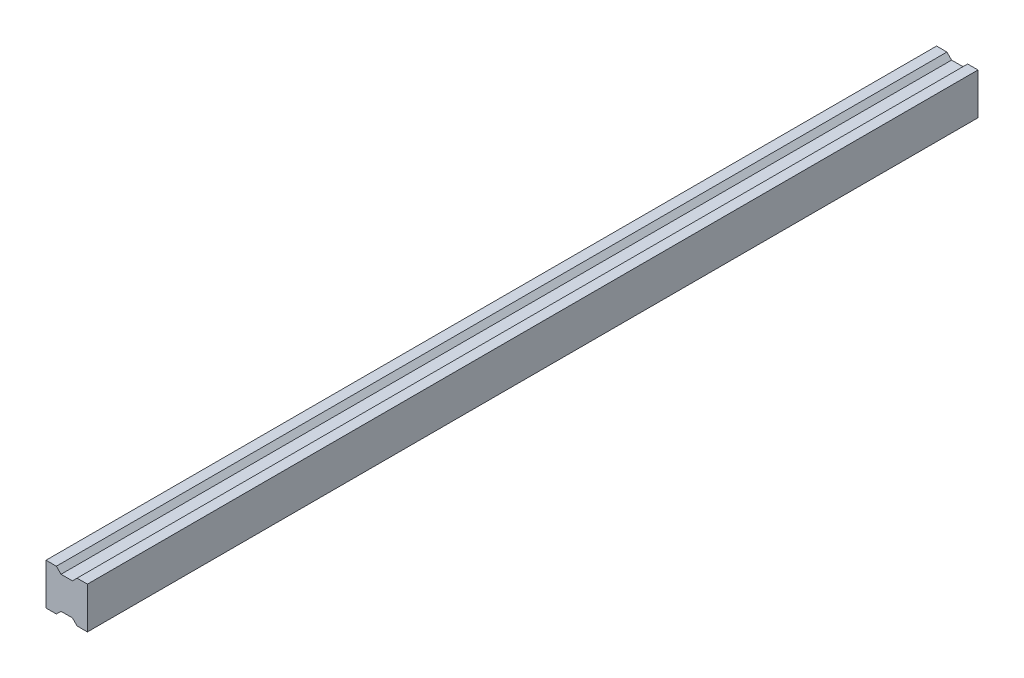
ISO-10303-21;
HEADER;
FILE_DESCRIPTION(('STEP AP214'),'2;1');
FILE_NAME('part.step','',(''),(''),'','','');
FILE_SCHEMA(('AUTOMOTIVE_DESIGN { 1 0 10303 214 1 1 1 1 }'));
ENDSEC;
DATA;
#1=APPLICATION_CONTEXT('core data for automotive mechanical design processes');
#2=APPLICATION_PROTOCOL_DEFINITION('international standard','automotive_design',2000,#1);
#3=PRODUCT_CONTEXT('',#1,'mechanical');
#4=PRODUCT('Part','Part','',(#3));
#5=PRODUCT_RELATED_PRODUCT_CATEGORY('part','',(#4));
#6=PRODUCT_DEFINITION_FORMATION('','',#4);
#7=PRODUCT_DEFINITION_CONTEXT('part definition',#1,'design');
#8=PRODUCT_DEFINITION('design','',#6,#7);
#9=PRODUCT_DEFINITION_SHAPE('','',#8);
#10=(LENGTH_UNIT() NAMED_UNIT(*) SI_UNIT(.MILLI.,.METRE.));
#11=(NAMED_UNIT(*) PLANE_ANGLE_UNIT() SI_UNIT($,.RADIAN.));
#12=(NAMED_UNIT(*) SI_UNIT($,.STERADIAN.) SOLID_ANGLE_UNIT());
#13=UNCERTAINTY_MEASURE_WITH_UNIT(LENGTH_MEASURE(1.E-05),#10,'distance_accuracy_value','');
#14=(GEOMETRIC_REPRESENTATION_CONTEXT(3) GLOBAL_UNCERTAINTY_ASSIGNED_CONTEXT((#13)) GLOBAL_UNIT_ASSIGNED_CONTEXT((#10,
#11,#12)) REPRESENTATION_CONTEXT('',''));
#15=CARTESIAN_POINT('',(0.,0.,0.));
#16=DIRECTION('',(0.,0.,1.));
#17=DIRECTION('',(1.,0.,0.));
#18=AXIS2_PLACEMENT_3D('',#15,#16,#17);
#19=CARTESIAN_POINT('',(-4.99999929826802,-9.99999739861189,430.));
#20=DIRECTION('',(-0.707106781186547,0.707106781186548,0.));
#21=DIRECTION('',(-0.707106781186548,-0.707106781186547,0.));
#22=AXIS2_PLACEMENT_3D('',#19,#20,#21);
#23=PLANE('',#22);
#24=DIRECTION('',(0.707106781186548,0.707106781186547,0.));
#25=VECTOR('',#24,1.);
#26=CARTESIAN_POINT('',(-4.99999929826802,-9.99999739861189,0.));
#27=LINE('',#26,#25);
#28=CARTESIAN_POINT('',(-4.99999929826802,-9.99999739861189,0.));
#29=VERTEX_POINT('',#28);
#30=CARTESIAN_POINT('',(-2.75000175683602,-7.74999985717989,0.));
#31=VERTEX_POINT('',#30);
#32=EDGE_CURVE('E157',#29,#31,#27,.T.);
#33=ORIENTED_EDGE('',*,*,#32,.T.);
#34=DIRECTION('',(0.,0.,-1.));
#35=VECTOR('',#34,1.);
#36=CARTESIAN_POINT('',(-2.75000175683602,-7.74999985717989,430.));
#37=LINE('',#36,#35);
#38=CARTESIAN_POINT('',(-2.75000175683602,-7.74999985717989,430.));
#39=VERTEX_POINT('',#38);
#40=EDGE_CURVE('E11',#39,#31,#37,.T.);
#41=ORIENTED_EDGE('',*,*,#40,.F.);
#42=DIRECTION('',(0.707106781186548,0.707106781186547,0.));
#43=VECTOR('',#42,1.);
#44=CARTESIAN_POINT('',(-4.99999929826802,-9.99999739861189,430.));
#45=LINE('',#44,#43);
#46=CARTESIAN_POINT('',(-4.99999929826802,-9.99999739861189,430.));
#47=VERTEX_POINT('',#46);
#48=EDGE_CURVE('E179',#47,#39,#45,.T.);
#49=ORIENTED_EDGE('',*,*,#48,.F.);
#50=DIRECTION('',(0.,0.,-1.));
#51=VECTOR('',#50,1.);
#52=CARTESIAN_POINT('',(-4.99999929826802,-9.99999739861189,430.));
#53=LINE('',#52,#51);
#54=EDGE_CURVE('E153',#47,#29,#53,.T.);
#55=ORIENTED_EDGE('',*,*,#54,.T.);
#56=EDGE_LOOP('',(#33,#41,#49,#55));
#57=FACE_BOUND('',#56,.T.);
#58=ADVANCED_FACE('F37',(#57),#23,.F.);
#59=CARTESIAN_POINT('',(-2.75000175683602,-7.74999985717989,430.));
#60=DIRECTION('',(0.,1.,0.));
#61=DIRECTION('',(0.,0.,1.));
#62=AXIS2_PLACEMENT_3D('',#59,#60,#61);
#63=PLANE('',#62);
#64=DIRECTION('',(1.,0.,0.));
#65=VECTOR('',#64,1.);
#66=CARTESIAN_POINT('',(-2.75000175683602,-7.74999985717989,0.));
#67=LINE('',#66,#65);
#68=CARTESIAN_POINT('',(2.74999862405027,-7.74999985717989,0.));
#69=VERTEX_POINT('',#68);
#70=EDGE_CURVE('E160',#31,#69,#67,.T.);
#71=ORIENTED_EDGE('',*,*,#70,.T.);
#72=DIRECTION('',(0.,0.,-1.));
#73=VECTOR('',#72,1.);
#74=CARTESIAN_POINT('',(2.74999862405027,-7.74999985717989,430.));
#75=LINE('',#74,#73);
#76=CARTESIAN_POINT('',(2.74999862405027,-7.74999985717989,430.));
#77=VERTEX_POINT('',#76);
#78=EDGE_CURVE('E45',#77,#69,#75,.T.);
#79=ORIENTED_EDGE('',*,*,#78,.F.);
#80=DIRECTION('',(1.,0.,0.));
#81=VECTOR('',#80,1.);
#82=CARTESIAN_POINT('',(-2.75000175683602,-7.74999985717989,430.));
#83=LINE('',#82,#81);
#84=EDGE_CURVE('E108',#39,#77,#83,.T.);
#85=ORIENTED_EDGE('',*,*,#84,.F.);
#86=ORIENTED_EDGE('',*,*,#40,.T.);
#87=EDGE_LOOP('',(#71,#79,#85,#86));
#88=FACE_BOUND('',#87,.T.);
#89=ADVANCED_FACE('F257',(#88),#63,.F.);
#90=CARTESIAN_POINT('',(2.74999862405027,-7.74999985717989,430.));
#91=DIRECTION('',(0.707106781186547,0.707106781186547,0.));
#92=DIRECTION('',(-0.707106781186548,0.707106781186548,0.));
#93=AXIS2_PLACEMENT_3D('',#90,#91,#92);
#94=PLANE('',#93);
#95=DIRECTION('',(0.707106781186547,-0.707106781186547,0.));
#96=VECTOR('',#95,1.);
#97=CARTESIAN_POINT('',(2.74999862405027,-7.74999985717989,0.));
#98=LINE('',#97,#96);
#99=CARTESIAN_POINT('',(4.99999616548227,-9.99999739861189,0.));
#100=VERTEX_POINT('',#99);
#101=EDGE_CURVE('E162',#69,#100,#98,.T.);
#102=ORIENTED_EDGE('',*,*,#101,.T.);
#103=DIRECTION('',(0.,0.,-1.));
#104=VECTOR('',#103,1.);
#105=CARTESIAN_POINT('',(4.99999616548227,-9.99999739861189,430.));
#106=LINE('',#105,#104);
#107=CARTESIAN_POINT('',(4.99999616548227,-9.99999739861189,430.));
#108=VERTEX_POINT('',#107);
#109=EDGE_CURVE('E198',#108,#100,#106,.T.);
#110=ORIENTED_EDGE('',*,*,#109,.F.);
#111=DIRECTION('',(0.707106781186547,-0.707106781186547,0.));
#112=VECTOR('',#111,1.);
#113=CARTESIAN_POINT('',(2.74999862405027,-7.74999985717989,430.));
#114=LINE('',#113,#112);
#115=EDGE_CURVE('E206',#77,#108,#114,.T.);
#116=ORIENTED_EDGE('',*,*,#115,.F.);
#117=ORIENTED_EDGE('',*,*,#78,.T.);
#118=EDGE_LOOP('',(#102,#110,#116,#117));
#119=FACE_BOUND('',#118,.T.);
#120=ADVANCED_FACE('F204',(#119),#94,.F.);
#121=CARTESIAN_POINT('',(4.99999616548227,-9.99999739861189,430.));
#122=DIRECTION('',(0.,1.,0.));
#123=DIRECTION('',(0.,0.,1.));
#124=AXIS2_PLACEMENT_3D('',#121,#122,#123);
#125=PLANE('',#124);
#126=DIRECTION('',(1.,0.,0.));
#127=VECTOR('',#126,1.);
#128=CARTESIAN_POINT('',(4.99999616548227,-9.99999739861189,0.));
#129=LINE('',#128,#127);
#130=CARTESIAN_POINT('',(9.99999703670611,-9.99999739861189,0.));
#131=VERTEX_POINT('',#130);
#132=EDGE_CURVE('E164',#100,#131,#129,.T.);
#133=ORIENTED_EDGE('',*,*,#132,.T.);
#134=DIRECTION('',(0.,0.,-1.));
#135=VECTOR('',#134,1.);
#136=CARTESIAN_POINT('',(9.99999703670611,-9.99999739861189,430.));
#137=LINE('',#136,#135);
#138=CARTESIAN_POINT('',(9.99999703670611,-9.99999739861189,430.));
#139=VERTEX_POINT('',#138);
#140=EDGE_CURVE('E195',#139,#131,#137,.T.);
#141=ORIENTED_EDGE('',*,*,#140,.F.);
#142=DIRECTION('',(1.,0.,0.));
#143=VECTOR('',#142,1.);
#144=CARTESIAN_POINT('',(4.99999616548227,-9.99999739861189,430.));
#145=LINE('',#144,#143);
#146=EDGE_CURVE('E224',#108,#139,#145,.T.);
#147=ORIENTED_EDGE('',*,*,#146,.F.);
#148=ORIENTED_EDGE('',*,*,#109,.T.);
#149=EDGE_LOOP('',(#133,#141,#147,#148));
#150=FACE_BOUND('',#149,.T.);
#151=ADVANCED_FACE('F215',(#150),#125,.F.);
#152=CARTESIAN_POINT('',(9.99999703670611,-9.99999739861189,430.));
#153=DIRECTION('',(-1.,0.,0.));
#154=DIRECTION('',(0.,0.,1.));
#155=AXIS2_PLACEMENT_3D('',#152,#153,#154);
#156=PLANE('',#155);
#157=DIRECTION('',(0.,1.,0.));
#158=VECTOR('',#157,1.);
#159=CARTESIAN_POINT('',(9.99999703670611,-9.99999739861189,0.));
#160=LINE('',#159,#158);
#161=CARTESIAN_POINT('',(9.99999703670611,10.0000023195377,0.));
#162=VERTEX_POINT('',#161);
#163=EDGE_CURVE('E166',#131,#162,#160,.T.);
#164=ORIENTED_EDGE('',*,*,#163,.T.);
#165=DIRECTION('',(0.,0.,-1.));
#166=VECTOR('',#165,1.);
#167=CARTESIAN_POINT('',(9.99999703670611,10.0000023195377,430.));
#168=LINE('',#167,#166);
#169=CARTESIAN_POINT('',(9.99999703670611,10.0000023195377,430.));
#170=VERTEX_POINT('',#169);
#171=EDGE_CURVE('E192',#170,#162,#168,.T.);
#172=ORIENTED_EDGE('',*,*,#171,.F.);
#173=DIRECTION('',(0.,1.,0.));
#174=VECTOR('',#173,1.);
#175=CARTESIAN_POINT('',(9.99999703670611,-9.99999739861189,430.));
#176=LINE('',#175,#174);
#177=EDGE_CURVE('E221',#139,#170,#176,.T.);
#178=ORIENTED_EDGE('',*,*,#177,.F.);
#179=ORIENTED_EDGE('',*,*,#140,.T.);
#180=EDGE_LOOP('',(#164,#172,#178,#179));
#181=FACE_BOUND('',#180,.T.);
#182=ADVANCED_FACE('F219',(#181),#156,.F.);
#183=CARTESIAN_POINT('',(9.99999703670611,10.0000023195377,430.));
#184=DIRECTION('',(0.,-1.,0.));
#185=DIRECTION('',(0.,0.,-1.));
#186=AXIS2_PLACEMENT_3D('',#183,#184,#185);
#187=PLANE('',#186);
#188=DIRECTION('',(-1.,0.,0.));
#189=VECTOR('',#188,1.);
#190=CARTESIAN_POINT('',(9.99999703670611,10.0000023195377,0.));
#191=LINE('',#190,#189);
#192=CARTESIAN_POINT('',(4.99999616548227,10.0000023195377,0.));
#193=VERTEX_POINT('',#192);
#194=EDGE_CURVE('E168',#162,#193,#191,.T.);
#195=ORIENTED_EDGE('',*,*,#194,.T.);
#196=DIRECTION('',(0.,0.,-1.));
#197=VECTOR('',#196,1.);
#198=CARTESIAN_POINT('',(4.99999616548227,10.0000023195377,430.));
#199=LINE('',#198,#197);
#200=CARTESIAN_POINT('',(4.99999616548227,10.0000023195377,430.));
#201=VERTEX_POINT('',#200);
#202=EDGE_CURVE('E189',#201,#193,#199,.T.);
#203=ORIENTED_EDGE('',*,*,#202,.F.);
#204=DIRECTION('',(-1.,0.,0.));
#205=VECTOR('',#204,1.);
#206=CARTESIAN_POINT('',(9.99999703670611,10.0000023195377,430.));
#207=LINE('',#206,#205);
#208=EDGE_CURVE('E223',#170,#201,#207,.T.);
#209=ORIENTED_EDGE('',*,*,#208,.F.);
#210=ORIENTED_EDGE('',*,*,#171,.T.);
#211=EDGE_LOOP('',(#195,#203,#209,#210));
#212=FACE_BOUND('',#211,.T.);
#213=ADVANCED_FACE('F270',(#212),#187,.F.);
#214=CARTESIAN_POINT('',(4.99999616548227,10.0000023195377,430.));
#215=DIRECTION('',(0.707106781186547,-0.707106781186548,0.));
#216=DIRECTION('',(0.707106781186548,0.707106781186547,0.));
#217=AXIS2_PLACEMENT_3D('',#214,#215,#216);
#218=PLANE('',#217);
#219=DIRECTION('',(-0.707106781186548,-0.707106781186547,0.));
#220=VECTOR('',#219,1.);
#221=CARTESIAN_POINT('',(4.99999616548227,10.0000023195377,0.));
#222=LINE('',#221,#220);
#223=CARTESIAN_POINT('',(2.74999862405027,7.75000477810574,0.));
#224=VERTEX_POINT('',#223);
#225=EDGE_CURVE('E170',#193,#224,#222,.T.);
#226=ORIENTED_EDGE('',*,*,#225,.T.);
#227=DIRECTION('',(0.,0.,-1.));
#228=VECTOR('',#227,1.);
#229=CARTESIAN_POINT('',(2.74999862405027,7.75000477810574,430.));
#230=LINE('',#229,#228);
#231=CARTESIAN_POINT('',(2.74999862405027,7.75000477810574,430.));
#232=VERTEX_POINT('',#231);
#233=EDGE_CURVE('E186',#232,#224,#230,.T.);
#234=ORIENTED_EDGE('',*,*,#233,.F.);
#235=DIRECTION('',(-0.707106781186548,-0.707106781186547,0.));
#236=VECTOR('',#235,1.);
#237=CARTESIAN_POINT('',(4.99999616548227,10.0000023195377,430.));
#238=LINE('',#237,#236);
#239=EDGE_CURVE('E226',#201,#232,#238,.T.);
#240=ORIENTED_EDGE('',*,*,#239,.F.);
#241=ORIENTED_EDGE('',*,*,#202,.T.);
#242=EDGE_LOOP('',(#226,#234,#240,#241));
#243=FACE_BOUND('',#242,.T.);
#244=ADVANCED_FACE('F273',(#243),#218,.F.);
#245=CARTESIAN_POINT('',(2.74999862405027,7.75000477810574,430.));
#246=DIRECTION('',(0.,-1.,0.));
#247=DIRECTION('',(0.,0.,-1.));
#248=AXIS2_PLACEMENT_3D('',#245,#246,#247);
#249=PLANE('',#248);
#250=DIRECTION('',(-1.,0.,0.));
#251=VECTOR('',#250,1.);
#252=CARTESIAN_POINT('',(2.74999862405027,7.75000477810574,0.));
#253=LINE('',#252,#251);
#254=CARTESIAN_POINT('',(-2.75000175683602,7.75000477810574,0.));
#255=VERTEX_POINT('',#254);
#256=EDGE_CURVE('E172',#224,#255,#253,.T.);
#257=ORIENTED_EDGE('',*,*,#256,.T.);
#258=DIRECTION('',(0.,0.,-1.));
#259=VECTOR('',#258,1.);
#260=CARTESIAN_POINT('',(-2.75000175683602,7.75000477810574,430.));
#261=LINE('',#260,#259);
#262=CARTESIAN_POINT('',(-2.75000175683602,7.75000477810574,430.));
#263=VERTEX_POINT('',#262);
#264=EDGE_CURVE('E183',#263,#255,#261,.T.);
#265=ORIENTED_EDGE('',*,*,#264,.F.);
#266=DIRECTION('',(-1.,0.,0.));
#267=VECTOR('',#266,1.);
#268=CARTESIAN_POINT('',(2.74999862405027,7.75000477810574,430.));
#269=LINE('',#268,#267);
#270=EDGE_CURVE('E232',#232,#263,#269,.T.);
#271=ORIENTED_EDGE('',*,*,#270,.F.);
#272=ORIENTED_EDGE('',*,*,#233,.T.);
#273=EDGE_LOOP('',(#257,#265,#271,#272));
#274=FACE_BOUND('',#273,.T.);
#275=ADVANCED_FACE('F238',(#274),#249,.F.);
#276=CARTESIAN_POINT('',(-2.75000175683602,7.75000477810574,430.));
#277=DIRECTION('',(-0.707106781186547,-0.707106781186548,0.));
#278=DIRECTION('',(0.707106781186548,-0.707106781186547,0.));
#279=AXIS2_PLACEMENT_3D('',#276,#277,#278);
#280=PLANE('',#279);
#281=DIRECTION('',(-0.707106781186548,0.707106781186547,0.));
#282=VECTOR('',#281,1.);
#283=CARTESIAN_POINT('',(-2.75000175683602,7.75000477810574,0.));
#284=LINE('',#283,#282);
#285=CARTESIAN_POINT('',(-4.99999929826802,10.0000023195377,0.));
#286=VERTEX_POINT('',#285);
#287=EDGE_CURVE('E174',#255,#286,#284,.T.);
#288=ORIENTED_EDGE('',*,*,#287,.T.);
#289=DIRECTION('',(0.,0.,-1.));
#290=VECTOR('',#289,1.);
#291=CARTESIAN_POINT('',(-4.99999929826802,10.0000023195377,430.));
#292=LINE('',#291,#290);
#293=CARTESIAN_POINT('',(-4.99999929826802,10.0000023195377,430.));
#294=VERTEX_POINT('',#293);
#295=EDGE_CURVE('E148',#294,#286,#292,.T.);
#296=ORIENTED_EDGE('',*,*,#295,.F.);
#297=DIRECTION('',(-0.707106781186548,0.707106781186547,0.));
#298=VECTOR('',#297,1.);
#299=CARTESIAN_POINT('',(-2.75000175683602,7.75000477810574,430.));
#300=LINE('',#299,#298);
#301=EDGE_CURVE('E139',#263,#294,#300,.T.);
#302=ORIENTED_EDGE('',*,*,#301,.F.);
#303=ORIENTED_EDGE('',*,*,#264,.T.);
#304=EDGE_LOOP('',(#288,#296,#302,#303));
#305=FACE_BOUND('',#304,.T.);
#306=ADVANCED_FACE('F242',(#305),#280,.F.);
#307=CARTESIAN_POINT('',(-4.99999929826802,10.0000023195377,430.));
#308=DIRECTION('',(0.,-1.,0.));
#309=DIRECTION('',(0.,0.,-1.));
#310=AXIS2_PLACEMENT_3D('',#307,#308,#309);
#311=PLANE('',#310);
#312=DIRECTION('',(-1.,0.,0.));
#313=VECTOR('',#312,1.);
#314=CARTESIAN_POINT('',(-4.99999929826802,10.0000023195377,0.));
#315=LINE('',#314,#313);
#316=CARTESIAN_POINT('',(-10.0000001694919,10.0000023195377,0.));
#317=VERTEX_POINT('',#316);
#318=EDGE_CURVE('E147',#286,#317,#315,.T.);
#319=ORIENTED_EDGE('',*,*,#318,.T.);
#320=DIRECTION('',(0.,0.,-1.));
#321=VECTOR('',#320,1.);
#322=CARTESIAN_POINT('',(-10.0000001694919,10.0000023195377,430.));
#323=LINE('',#322,#321);
#324=CARTESIAN_POINT('',(-10.0000001694919,10.0000023195377,430.));
#325=VERTEX_POINT('',#324);
#326=EDGE_CURVE('E144',#325,#317,#323,.T.);
#327=ORIENTED_EDGE('',*,*,#326,.F.);
#328=DIRECTION('',(-1.,0.,0.));
#329=VECTOR('',#328,1.);
#330=CARTESIAN_POINT('',(-4.99999929826802,10.0000023195377,430.));
#331=LINE('',#330,#329);
#332=EDGE_CURVE('E133',#294,#325,#331,.T.);
#333=ORIENTED_EDGE('',*,*,#332,.F.);
#334=ORIENTED_EDGE('',*,*,#295,.T.);
#335=EDGE_LOOP('',(#319,#327,#333,#334));
#336=FACE_BOUND('',#335,.T.);
#337=ADVANCED_FACE('F145',(#336),#311,.F.);
#338=CARTESIAN_POINT('',(-10.0000001694919,10.0000023195377,430.));
#339=DIRECTION('',(1.,0.,0.));
#340=DIRECTION('',(0.,0.,-1.));
#341=AXIS2_PLACEMENT_3D('',#338,#339,#340);
#342=PLANE('',#341);
#343=DIRECTION('',(0.,-1.,0.));
#344=VECTOR('',#343,1.);
#345=CARTESIAN_POINT('',(-10.0000001694919,10.0000023195377,0.));
#346=LINE('',#345,#344);
#347=CARTESIAN_POINT('',(-10.0000001694919,-9.99999739861189,0.));
#348=VERTEX_POINT('',#347);
#349=EDGE_CURVE('E94',#317,#348,#346,.T.);
#350=ORIENTED_EDGE('',*,*,#349,.T.);
#351=DIRECTION('',(0.,0.,-1.));
#352=VECTOR('',#351,1.);
#353=CARTESIAN_POINT('',(-10.0000001694919,-9.99999739861189,430.));
#354=LINE('',#353,#352);
#355=CARTESIAN_POINT('',(-10.0000001694919,-9.99999739861189,430.));
#356=VERTEX_POINT('',#355);
#357=EDGE_CURVE('E149',#356,#348,#354,.T.);
#358=ORIENTED_EDGE('',*,*,#357,.F.);
#359=DIRECTION('',(0.,-1.,0.));
#360=VECTOR('',#359,1.);
#361=CARTESIAN_POINT('',(-10.0000001694919,10.0000023195377,430.));
#362=LINE('',#361,#360);
#363=EDGE_CURVE('E137',#325,#356,#362,.T.);
#364=ORIENTED_EDGE('',*,*,#363,.F.);
#365=ORIENTED_EDGE('',*,*,#326,.T.);
#366=EDGE_LOOP('',(#350,#358,#364,#365));
#367=FACE_BOUND('',#366,.T.);
#368=ADVANCED_FACE('F151',(#367),#342,.F.);
#369=CARTESIAN_POINT('',(-10.0000001694919,-9.99999739861189,430.));
#370=DIRECTION('',(0.,1.,0.));
#371=DIRECTION('',(0.,0.,1.));
#372=AXIS2_PLACEMENT_3D('',#369,#370,#371);
#373=PLANE('',#372);
#374=DIRECTION('',(1.,0.,0.));
#375=VECTOR('',#374,1.);
#376=CARTESIAN_POINT('',(-10.0000001694919,-9.99999739861189,0.));
#377=LINE('',#376,#375);
#378=EDGE_CURVE('E100',#348,#29,#377,.T.);
#379=ORIENTED_EDGE('',*,*,#378,.T.);
#380=ORIENTED_EDGE('',*,*,#54,.F.);
#381=DIRECTION('',(1.,0.,0.));
#382=VECTOR('',#381,1.);
#383=CARTESIAN_POINT('',(-10.0000001694919,-9.99999739861189,430.));
#384=LINE('',#383,#382);
#385=EDGE_CURVE('E53',#356,#47,#384,.T.);
#386=ORIENTED_EDGE('',*,*,#385,.F.);
#387=ORIENTED_EDGE('',*,*,#357,.T.);
#388=EDGE_LOOP('',(#379,#380,#386,#387));
#389=FACE_BOUND('',#388,.T.);
#390=ADVANCED_FACE('F246',(#389),#373,.F.);
#391=CARTESIAN_POINT('',(0.,0.,430.));
#392=DIRECTION('',(0.,0.,-1.));
#393=DIRECTION('',(-1.,0.,0.));
#394=AXIS2_PLACEMENT_3D('',#391,#392,#393);
#395=PLANE('',#394);
#396=ORIENTED_EDGE('',*,*,#48,.T.);
#397=ORIENTED_EDGE('',*,*,#84,.T.);
#398=ORIENTED_EDGE('',*,*,#115,.T.);
#399=ORIENTED_EDGE('',*,*,#146,.T.);
#400=ORIENTED_EDGE('',*,*,#177,.T.);
#401=ORIENTED_EDGE('',*,*,#208,.T.);
#402=ORIENTED_EDGE('',*,*,#239,.T.);
#403=ORIENTED_EDGE('',*,*,#270,.T.);
#404=ORIENTED_EDGE('',*,*,#301,.T.);
#405=ORIENTED_EDGE('',*,*,#332,.T.);
#406=ORIENTED_EDGE('',*,*,#363,.T.);
#407=ORIENTED_EDGE('',*,*,#385,.T.);
#408=EDGE_LOOP('',(#396,#397,#398,#399,#400,#401,#402,#403,#404,#405,#406,#407));
#409=FACE_BOUND('',#408,.T.);
#410=ADVANCED_FACE('F135',(#409),#395,.F.);
#411=CARTESIAN_POINT('',(0.,0.,0.));
#412=DIRECTION('',(0.,0.,-1.));
#413=DIRECTION('',(-1.,0.,0.));
#414=AXIS2_PLACEMENT_3D('',#411,#412,#413);
#415=PLANE('',#414);
#416=ORIENTED_EDGE('',*,*,#32,.F.);
#417=ORIENTED_EDGE('',*,*,#378,.F.);
#418=ORIENTED_EDGE('',*,*,#349,.F.);
#419=ORIENTED_EDGE('',*,*,#318,.F.);
#420=ORIENTED_EDGE('',*,*,#287,.F.);
#421=ORIENTED_EDGE('',*,*,#256,.F.);
#422=ORIENTED_EDGE('',*,*,#225,.F.);
#423=ORIENTED_EDGE('',*,*,#194,.F.);
#424=ORIENTED_EDGE('',*,*,#163,.F.);
#425=ORIENTED_EDGE('',*,*,#132,.F.);
#426=ORIENTED_EDGE('',*,*,#101,.F.);
#427=ORIENTED_EDGE('',*,*,#70,.F.);
#428=EDGE_LOOP('',(#416,#417,#418,#419,#420,#421,#422,#423,#424,#425,#426,#427));
#429=FACE_BOUND('',#428,.T.);
#430=ADVANCED_FACE('F210',(#429),#415,.T.);
#431=CLOSED_SHELL('',(#58,#89,#120,#151,#182,#213,#244,#275,#306,#337,#368,#390,#410,#430));
#432=MANIFOLD_SOLID_BREP('B2',#431);
#433=ADVANCED_BREP_SHAPE_REPRESENTATION('',(#18,#432),#14);
#434=SHAPE_DEFINITION_REPRESENTATION(#9,#433);
ENDSEC;
END-ISO-10303-21;
